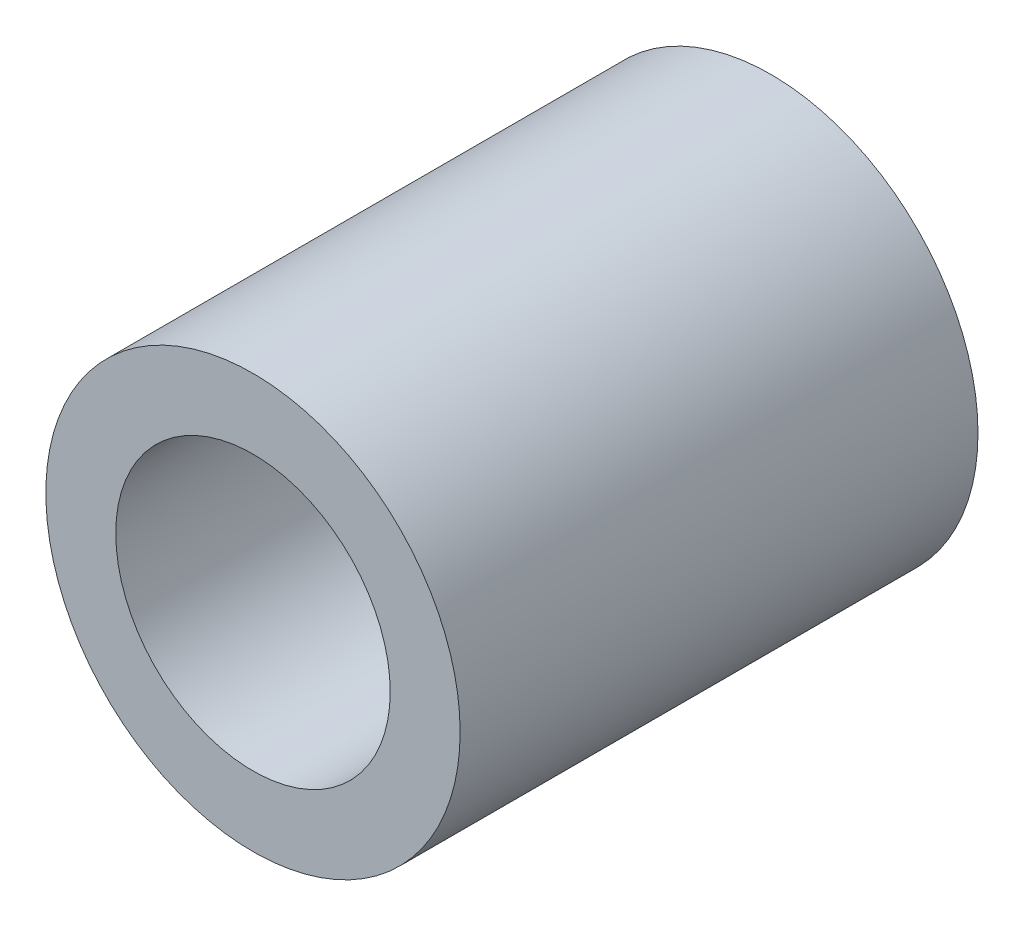
ISO-10303-21;
HEADER;
FILE_DESCRIPTION(('STEP AP214'),'2;1');
FILE_NAME('part.step','',(''),(''),'','','');
FILE_SCHEMA(('AUTOMOTIVE_DESIGN { 1 0 10303 214 1 1 1 1 }'));
ENDSEC;
DATA;
#1=APPLICATION_CONTEXT('core data for automotive mechanical design processes');
#2=APPLICATION_PROTOCOL_DEFINITION('international standard','automotive_design',2000,#1);
#3=PRODUCT_CONTEXT('',#1,'mechanical');
#4=PRODUCT('Part','Part','',(#3));
#5=PRODUCT_RELATED_PRODUCT_CATEGORY('part','',(#4));
#6=PRODUCT_DEFINITION_FORMATION('','',#4);
#7=PRODUCT_DEFINITION_CONTEXT('part definition',#1,'design');
#8=PRODUCT_DEFINITION('design','',#6,#7);
#9=PRODUCT_DEFINITION_SHAPE('','',#8);
#10=(LENGTH_UNIT() NAMED_UNIT(*) SI_UNIT(.MILLI.,.METRE.));
#11=(NAMED_UNIT(*) PLANE_ANGLE_UNIT() SI_UNIT($,.RADIAN.));
#12=(NAMED_UNIT(*) SI_UNIT($,.STERADIAN.) SOLID_ANGLE_UNIT());
#13=UNCERTAINTY_MEASURE_WITH_UNIT(LENGTH_MEASURE(1.E-05),#10,'distance_accuracy_value','');
#14=(GEOMETRIC_REPRESENTATION_CONTEXT(3) GLOBAL_UNCERTAINTY_ASSIGNED_CONTEXT((#13)) GLOBAL_UNIT_ASSIGNED_CONTEXT((#10,
#11,#12)) REPRESENTATION_CONTEXT('',''));
#15=CARTESIAN_POINT('',(0.,0.,0.));
#16=DIRECTION('',(0.,0.,1.));
#17=DIRECTION('',(1.,0.,0.));
#18=AXIS2_PLACEMENT_3D('',#15,#16,#17);
#19=CARTESIAN_POINT('',(0.,0.,-5.));
#20=DIRECTION('',(0.,0.,1.));
#21=DIRECTION('',(1.,0.,0.));
#22=AXIS2_PLACEMENT_3D('',#19,#20,#21);
#23=PLANE('',#22);
#24=CARTESIAN_POINT('',(0.,0.,-5.));
#25=DIRECTION('',(0.,0.,1.));
#26=DIRECTION('',(1.,0.,0.));
#27=AXIS2_PLACEMENT_3D('',#24,#25,#26);
#28=CIRCLE('',#27,2.65);
#29=CARTESIAN_POINT('',(2.65,0.,-5.));
#30=VERTEX_POINT('',#29);
#31=EDGE_CURVE('E60',#30,#30,#28,.T.);
#32=ORIENTED_EDGE('',*,*,#31,.T.);
#33=EDGE_LOOP('',(#32));
#34=FACE_BOUND('',#33,.T.);
#35=CARTESIAN_POINT('',(0.,0.,-5.));
#36=DIRECTION('',(0.,0.,1.));
#37=DIRECTION('',(1.,0.,0.));
#38=AXIS2_PLACEMENT_3D('',#35,#36,#37);
#39=CIRCLE('',#38,4.);
#40=CARTESIAN_POINT('',(4.,0.,-5.));
#41=VERTEX_POINT('',#40);
#42=EDGE_CURVE('E21',#41,#41,#39,.T.);
#43=ORIENTED_EDGE('',*,*,#42,.F.);
#44=EDGE_LOOP('',(#43));
#45=FACE_BOUND('',#44,.T.);
#46=ADVANCED_FACE('F17',(#34,#45),#23,.F.);
#47=CARTESIAN_POINT('',(0.,0.,5.));
#48=DIRECTION('',(0.,0.,1.));
#49=DIRECTION('',(1.,0.,0.));
#50=AXIS2_PLACEMENT_3D('',#47,#48,#49);
#51=PLANE('',#50);
#52=CARTESIAN_POINT('',(0.,0.,5.));
#53=DIRECTION('',(0.,0.,1.));
#54=DIRECTION('',(1.,0.,0.));
#55=AXIS2_PLACEMENT_3D('',#52,#53,#54);
#56=CIRCLE('',#55,2.65);
#57=CARTESIAN_POINT('',(2.65,0.,5.));
#58=VERTEX_POINT('',#57);
#59=EDGE_CURVE('E59',#58,#58,#56,.T.);
#60=ORIENTED_EDGE('',*,*,#59,.F.);
#61=EDGE_LOOP('',(#60));
#62=FACE_BOUND('',#61,.T.);
#63=CARTESIAN_POINT('',(0.,0.,5.));
#64=DIRECTION('',(0.,0.,1.));
#65=DIRECTION('',(1.,0.,0.));
#66=AXIS2_PLACEMENT_3D('',#63,#64,#65);
#67=CIRCLE('',#66,4.);
#68=CARTESIAN_POINT('',(4.,0.,5.));
#69=VERTEX_POINT('',#68);
#70=EDGE_CURVE('E11',#69,#69,#67,.T.);
#71=ORIENTED_EDGE('',*,*,#70,.T.);
#72=EDGE_LOOP('',(#71));
#73=FACE_BOUND('',#72,.T.);
#74=ADVANCED_FACE('F19',(#62,#73),#51,.T.);
#75=CARTESIAN_POINT('',(0.,0.,5.));
#76=DIRECTION('',(0.,0.,-1.));
#77=DIRECTION('',(-1.,0.,0.));
#78=AXIS2_PLACEMENT_3D('',#75,#76,#77);
#79=CYLINDRICAL_SURFACE('',#78,4.);
#80=ORIENTED_EDGE('',*,*,#42,.T.);
#81=DIRECTION('',(0.,0.,1.));
#82=VECTOR('',#81,1.);
#83=CARTESIAN_POINT('',(4.,0.,5.));
#84=LINE('',#83,#82);
#85=EDGE_CURVE('E27',#41,#69,#84,.T.);
#86=ORIENTED_EDGE('',*,*,#85,.T.);
#87=ORIENTED_EDGE('',*,*,#70,.F.);
#88=ORIENTED_EDGE('',*,*,#85,.F.);
#89=EDGE_LOOP('',(#80,#86,#87,#88));
#90=FACE_BOUND('',#89,.T.);
#91=ADVANCED_FACE('F77',(#90),#79,.T.);
#92=CARTESIAN_POINT('',(0.,0.,5.));
#93=DIRECTION('',(0.,0.,-1.));
#94=DIRECTION('',(-1.,0.,0.));
#95=AXIS2_PLACEMENT_3D('',#92,#93,#94);
#96=CYLINDRICAL_SURFACE('',#95,2.65);
#97=ORIENTED_EDGE('',*,*,#59,.T.);
#98=DIRECTION('',(0.,0.,-1.));
#99=VECTOR('',#98,1.);
#100=CARTESIAN_POINT('',(2.65,0.,5.));
#101=LINE('',#100,#99);
#102=EDGE_CURVE('E56',#58,#30,#101,.T.);
#103=ORIENTED_EDGE('',*,*,#102,.T.);
#104=ORIENTED_EDGE('',*,*,#31,.F.);
#105=ORIENTED_EDGE('',*,*,#102,.F.);
#106=EDGE_LOOP('',(#97,#103,#104,#105));
#107=FACE_BOUND('',#106,.T.);
#108=ADVANCED_FACE('F57',(#107),#96,.F.);
#109=CLOSED_SHELL('',(#46,#74,#91,#108));
#110=MANIFOLD_SOLID_BREP('B1',#109);
#111=ADVANCED_BREP_SHAPE_REPRESENTATION('',(#18,#110),#14);
#112=SHAPE_DEFINITION_REPRESENTATION(#9,#111);
ENDSEC;
END-ISO-10303-21;
